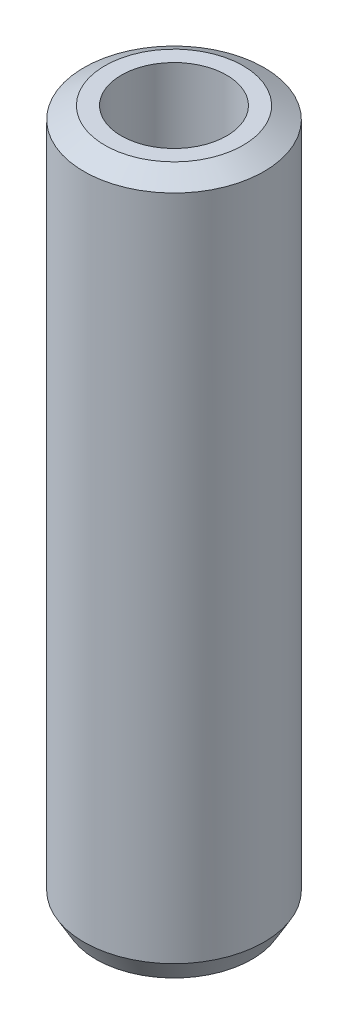
ISO-10303-21;
HEADER;
FILE_DESCRIPTION(('STEP AP214'),'2;1');
FILE_NAME('part.step','',(''),(''),'','','');
FILE_SCHEMA(('AUTOMOTIVE_DESIGN { 1 0 10303 214 1 1 1 1 }'));
ENDSEC;
DATA;
#1=APPLICATION_CONTEXT('core data for automotive mechanical design processes');
#2=APPLICATION_PROTOCOL_DEFINITION('international standard','automotive_design',2000,#1);
#3=PRODUCT_CONTEXT('',#1,'mechanical');
#4=PRODUCT('Part','Part','',(#3));
#5=PRODUCT_RELATED_PRODUCT_CATEGORY('part','',(#4));
#6=PRODUCT_DEFINITION_FORMATION('','',#4);
#7=PRODUCT_DEFINITION_CONTEXT('part definition',#1,'design');
#8=PRODUCT_DEFINITION('design','',#6,#7);
#9=PRODUCT_DEFINITION_SHAPE('','',#8);
#10=(LENGTH_UNIT() NAMED_UNIT(*) SI_UNIT(.MILLI.,.METRE.));
#11=(NAMED_UNIT(*) PLANE_ANGLE_UNIT() SI_UNIT($,.RADIAN.));
#12=(NAMED_UNIT(*) SI_UNIT($,.STERADIAN.) SOLID_ANGLE_UNIT());
#13=UNCERTAINTY_MEASURE_WITH_UNIT(LENGTH_MEASURE(1.E-05),#10,'distance_accuracy_value','');
#14=(GEOMETRIC_REPRESENTATION_CONTEXT(3) GLOBAL_UNCERTAINTY_ASSIGNED_CONTEXT((#13)) GLOBAL_UNIT_ASSIGNED_CONTEXT((#10,
#11,#12)) REPRESENTATION_CONTEXT('',''));
#15=CARTESIAN_POINT('',(0.,0.,0.));
#16=DIRECTION('',(0.,0.,1.));
#17=DIRECTION('',(1.,0.,0.));
#18=AXIS2_PLACEMENT_3D('',#15,#16,#17);
#19=CARTESIAN_POINT('',(0.,233.354073189803,0.));
#20=DIRECTION('',(0.,-1.,0.));
#21=DIRECTION('',(0.,0.,-1.));
#22=AXIS2_PLACEMENT_3D('',#19,#20,#21);
#23=CYLINDRICAL_SURFACE('',#22,30.);
#24=CARTESIAN_POINT('',(0.,229.31092209963,0.));
#25=DIRECTION('',(0.,1.,0.));
#26=DIRECTION('',(0.,0.,1.));
#27=AXIS2_PLACEMENT_3D('',#24,#25,#26);
#28=CIRCLE('',#27,30.);
#29=CARTESIAN_POINT('',(0.,229.31092209963,-30.));
#30=VERTEX_POINT('',#29);
#31=EDGE_CURVE('E50',#30,#30,#28,.F.);
#32=ORIENTED_EDGE('',*,*,#31,.T.);
#33=EDGE_LOOP('',(#32));
#34=FACE_BOUND('',#33,.T.);
#35=CARTESIAN_POINT('',(0.,7.00294311085678,0.));
#36=DIRECTION('',(0.,1.,0.));
#37=DIRECTION('',(0.,0.,1.));
#38=AXIS2_PLACEMENT_3D('',#35,#36,#37);
#39=CIRCLE('',#38,30.);
#40=CARTESIAN_POINT('',(0.,7.00294311085678,30.));
#41=VERTEX_POINT('',#40);
#42=EDGE_CURVE('E51',#41,#41,#39,.T.);
#43=ORIENTED_EDGE('',*,*,#42,.T.);
#44=EDGE_LOOP('',(#43));
#45=FACE_BOUND('',#44,.T.);
#46=ADVANCED_FACE('F39',(#34,#45),#23,.T.);
#47=CARTESIAN_POINT('',(0.,233.354073189803,0.));
#48=DIRECTION('',(0.,1.,0.));
#49=DIRECTION('',(0.,0.,1.));
#50=AXIS2_PLACEMENT_3D('',#47,#48,#49);
#51=PLANE('',#50);
#52=CARTESIAN_POINT('',(0.,233.354073189803,0.));
#53=DIRECTION('',(0.,1.,0.));
#54=DIRECTION('',(0.,0.,1.));
#55=AXIS2_PLACEMENT_3D('',#52,#53,#54);
#56=CIRCLE('',#55,22.9970568891434);
#57=CARTESIAN_POINT('',(0.,233.354073189803,-22.9970568891434));
#58=VERTEX_POINT('',#57);
#59=EDGE_CURVE('E54',#58,#58,#56,.T.);
#60=ORIENTED_EDGE('',*,*,#59,.T.);
#61=EDGE_LOOP('',(#60));
#62=FACE_BOUND('',#61,.T.);
#63=CARTESIAN_POINT('',(0.,233.354073189803,0.));
#64=DIRECTION('',(0.,1.,0.));
#65=DIRECTION('',(0.,0.,1.));
#66=AXIS2_PLACEMENT_3D('',#63,#64,#65);
#67=CIRCLE('',#66,17.5480515872049);
#68=CARTESIAN_POINT('',(0.,233.354073189803,17.5480515872049));
#69=VERTEX_POINT('',#68);
#70=EDGE_CURVE('E58',#69,#69,#67,.T.);
#71=ORIENTED_EDGE('',*,*,#70,.F.);
#72=EDGE_LOOP('',(#71));
#73=FACE_BOUND('',#72,.T.);
#74=ADVANCED_FACE('F69',(#62,#73),#51,.T.);
#75=CARTESIAN_POINT('',(0.,0.,0.));
#76=DIRECTION('',(0.,1.,0.));
#77=DIRECTION('',(0.,0.,1.));
#78=AXIS2_PLACEMENT_3D('',#75,#76,#77);
#79=PLANE('',#78);
#80=CARTESIAN_POINT('',(0.,0.,0.));
#81=DIRECTION('',(0.,1.,0.));
#82=DIRECTION('',(0.,0.,1.));
#83=AXIS2_PLACEMENT_3D('',#80,#81,#82);
#84=CIRCLE('',#83,25.9568489098272);
#85=CARTESIAN_POINT('',(0.,0.,25.9568489098272));
#86=VERTEX_POINT('',#85);
#87=EDGE_CURVE('E10',#86,#86,#84,.F.);
#88=ORIENTED_EDGE('',*,*,#87,.T.);
#89=EDGE_LOOP('',(#88));
#90=FACE_BOUND('',#89,.T.);
#91=CARTESIAN_POINT('',(0.,0.,0.));
#92=DIRECTION('',(0.,1.,0.));
#93=DIRECTION('',(0.,0.,1.));
#94=AXIS2_PLACEMENT_3D('',#91,#92,#93);
#95=CIRCLE('',#94,17.5480515872049);
#96=CARTESIAN_POINT('',(0.,0.,17.5480515872049));
#97=VERTEX_POINT('',#96);
#98=EDGE_CURVE('E63',#97,#97,#95,.T.);
#99=ORIENTED_EDGE('',*,*,#98,.T.);
#100=EDGE_LOOP('',(#99));
#101=FACE_BOUND('',#100,.T.);
#102=ADVANCED_FACE('F75',(#90,#101),#79,.F.);
#103=CARTESIAN_POINT('',(0.,233.354073189803,0.));
#104=DIRECTION('',(0.,-1.,0.));
#105=DIRECTION('',(0.,0.,-1.));
#106=AXIS2_PLACEMENT_3D('',#103,#104,#105);
#107=CYLINDRICAL_SURFACE('',#106,17.5480515872049);
#108=ORIENTED_EDGE('',*,*,#70,.T.);
#109=EDGE_LOOP('',(#108));
#110=FACE_BOUND('',#109,.T.);
#111=ORIENTED_EDGE('',*,*,#98,.F.);
#112=EDGE_LOOP('',(#111));
#113=FACE_BOUND('',#112,.T.);
#114=ADVANCED_FACE('F70',(#110,#113),#107,.F.);
#115=CARTESIAN_POINT('',(0.,233.354073189803,0.));
#116=DIRECTION('',(0.,-1.,0.));
#117=DIRECTION('',(0.,0.,-1.));
#118=AXIS2_PLACEMENT_3D('',#115,#116,#117);
#119=CONICAL_SURFACE('',#118,22.9970568891434,1.04719755119659);
#120=CARTESIAN_POINT('',(0.,229.31092209963,-30.));
#121=CARTESIAN_POINT('',(0.,229.353038256819,-29.9270526759286));
#122=CARTESIAN_POINT('',(0.,229.395154414008,-29.8541053518572));
#123=CARTESIAN_POINT('',(0.,229.479386728387,-29.7082107037143));
#124=CARTESIAN_POINT('',(0.,229.521502885576,-29.6352633796429));
#125=CARTESIAN_POINT('',(0.,229.605735199955,-29.4893687315001));
#126=CARTESIAN_POINT('',(0.,229.647851357144,-29.4164214074286));
#127=CARTESIAN_POINT('',(0.,229.732083671523,-29.2705267592858));
#128=CARTESIAN_POINT('',(0.,229.774199828712,-29.1975794352144));
#129=CARTESIAN_POINT('',(0.,229.858432143091,-29.0516847870715));
#130=CARTESIAN_POINT('',(0.,229.90054830028,-28.9787374630001));
#131=CARTESIAN_POINT('',(0.,229.984780614659,-28.8328428148572));
#132=CARTESIAN_POINT('',(0.,230.026896771848,-28.7598954907858));
#133=CARTESIAN_POINT('',(0.,230.111129086226,-28.614000842643));
#134=CARTESIAN_POINT('',(0.,230.153245243416,-28.5410535185716));
#135=CARTESIAN_POINT('',(0.,230.237477557794,-28.3951588704287));
#136=CARTESIAN_POINT('',(0.,230.279593714984,-28.3222115463573));
#137=CARTESIAN_POINT('',(0.,230.363826029362,-28.1763168982144));
#138=CARTESIAN_POINT('',(0.,230.405942186552,-28.103369574143));
#139=CARTESIAN_POINT('',(0.,230.49017450093,-27.9574749260002));
#140=CARTESIAN_POINT('',(0.,230.53229065812,-27.8845276019287));
#141=CARTESIAN_POINT('',(0.,230.616522972498,-27.7386329537859));
#142=CARTESIAN_POINT('',(0.,230.658639129687,-27.6656856297145));
#143=CARTESIAN_POINT('',(0.,230.742871444066,-27.5197909815716));
#144=CARTESIAN_POINT('',(0.,230.784987601255,-27.4468436575002));
#145=CARTESIAN_POINT('',(0.,230.869219915634,-27.3009490093574));
#146=CARTESIAN_POINT('',(0.,230.911336072823,-27.2280016852859));
#147=CARTESIAN_POINT('',(0.,230.995568387202,-27.0821070371431));
#148=CARTESIAN_POINT('',(0.,231.037684544391,-27.0091597130717));
#149=CARTESIAN_POINT('',(0.,231.12191685877,-26.8632650649288));
#150=CARTESIAN_POINT('',(0.,231.164033015959,-26.7903177408574));
#151=CARTESIAN_POINT('',(0.,231.248265330338,-26.6444230927146));
#152=CARTESIAN_POINT('',(0.,231.290381487527,-26.5714757686431));
#153=CARTESIAN_POINT('',(0.,231.374613801905,-26.4255811205003));
#154=CARTESIAN_POINT('',(0.,231.416729959095,-26.3526337964289));
#155=CARTESIAN_POINT('',(0.,231.500962273473,-26.206739148286));
#156=CARTESIAN_POINT('',(0.,231.543078430663,-26.1337918242146));
#157=CARTESIAN_POINT('',(0.,231.627310745041,-25.9878971760717));
#158=CARTESIAN_POINT('',(0.,231.669426902231,-25.9149498520003));
#159=CARTESIAN_POINT('',(0.,231.753659216609,-25.7690552038575));
#160=CARTESIAN_POINT('',(0.,231.795775373799,-25.696107879786));
#161=CARTESIAN_POINT('',(0.,231.880007688177,-25.5502132316432));
#162=CARTESIAN_POINT('',(0.,231.922123845366,-25.4772659075718));
#163=CARTESIAN_POINT('',(0.,232.006356159745,-25.3313712594289));
#164=CARTESIAN_POINT('',(0.,232.048472316934,-25.2584239353575));
#165=CARTESIAN_POINT('',(0.,232.132704631313,-25.1125292872147));
#166=CARTESIAN_POINT('',(0.,232.174820788502,-25.0395819631432));
#167=CARTESIAN_POINT('',(0.,232.259053102881,-24.8936873150004));
#168=CARTESIAN_POINT('',(0.,232.30116926007,-24.820739990929));
#169=CARTESIAN_POINT('',(0.,232.385401574449,-24.6748453427861));
#170=CARTESIAN_POINT('',(0.,232.427517731638,-24.6018980187147));
#171=CARTESIAN_POINT('',(0.,232.511750046017,-24.4560033705718));
#172=CARTESIAN_POINT('',(0.,232.553866203206,-24.3830560465004));
#173=CARTESIAN_POINT('',(0.,232.638098517584,-24.2371613983576));
#174=CARTESIAN_POINT('',(0.,232.680214674774,-24.1642140742862));
#175=CARTESIAN_POINT('',(0.,232.764446989152,-24.0183194261433));
#176=CARTESIAN_POINT('',(0.,232.806563146342,-23.9453721020719));
#177=CARTESIAN_POINT('',(0.,232.89079546072,-23.799477453929));
#178=CARTESIAN_POINT('',(0.,232.93291161791,-23.7265301298576));
#179=CARTESIAN_POINT('',(0.,233.017143932288,-23.5806354817148));
#180=CARTESIAN_POINT('',(0.,233.059260089477,-23.5076881576433));
#181=CARTESIAN_POINT('',(0.,233.143492403856,-23.3617935095005));
#182=CARTESIAN_POINT('',(0.,233.185608561045,-23.2888461854291));
#183=CARTESIAN_POINT('',(0.,233.269840875424,-23.1429515372862));
#184=CARTESIAN_POINT('',(0.,233.311957032613,-23.0700042132148));
#185=CARTESIAN_POINT('',(0.,233.354073189803,-22.9970568891434));
#186=B_SPLINE_CURVE_WITH_KNOTS('',3,(#120,#121,#122,#123,#124,#125,#126,#127,#128,#129,#130,
#131,#132,#133,#134,#135,#136,#137,#138,#139,#140,#141,#142,#143,#144,#145,#146,#147,#148,#149,
#150,#151,#152,#153,#154,#155,#156,#157,#158,#159,#160,#161,#162,#163,#164,#165,#166,#167,#168,
#169,#170,#171,#172,#173,#174,#175,#176,#177,#178,#179,#180,#181,#182,#183,#184,#185),
.UNSPECIFIED.,.F.,.F.,(4,2,2,2,2,2,2,2,2,2,2,2,2,2,2,2,2,2,2,2,2,2,2,2,2,2,2,2,2,2,2,2,4),(0.,
0.252696943135809,0.5053938862716,0.758090829407395,1.01078777254319,1.26348471567898,
1.51618165881478,1.76887860195058,2.02157554508637,2.27427248822217,2.52696943135796,
2.77966637449376,3.03236331762955,3.28506026076536,3.53775720390115,3.79045414703694,
4.04315109017274,4.29584803330853,4.54854497644432,4.80124191958012,5.05393886271592,
5.30663580585172,5.55933274898751,5.8120296921233,6.0647266352591,6.31742357839489,
6.5701205215307,6.82281746466649,7.07551440780228,7.32821135093808,7.58090829407387,
7.83360523720966,8.08630218034547),.UNSPECIFIED.);
#187=EDGE_CURVE('BSEAM81',#30,#58,#186,.T.);
#188=ORIENTED_EDGE('',*,*,#31,.F.);
#189=ORIENTED_EDGE('',*,*,#59,.F.);
#190=ORIENTED_EDGE('',*,*,#187,.T.);
#191=ORIENTED_EDGE('',*,*,#187,.F.);
#192=EDGE_LOOP('',(#188,#190,#189,#191));
#193=FACE_BOUND('',#192,.T.);
#194=ADVANCED_FACE('F81',(#193),#119,.T.);
#195=CARTESIAN_POINT('',(0.,7.00294311085678,0.));
#196=DIRECTION('',(0.,1.,0.));
#197=DIRECTION('',(0.,0.,1.));
#198=AXIS2_PLACEMENT_3D('',#195,#196,#197);
#199=CONICAL_SURFACE('',#198,30.,0.523598775598303);
#200=ORIENTED_EDGE('',*,*,#87,.F.);
#201=EDGE_LOOP('',(#200));
#202=FACE_BOUND('',#201,.T.);
#203=ORIENTED_EDGE('',*,*,#42,.F.);
#204=EDGE_LOOP('',(#203));
#205=FACE_BOUND('',#204,.T.);
#206=ADVANCED_FACE('F45',(#202,#205),#199,.T.);
#207=CLOSED_SHELL('',(#46,#74,#102,#114,#194,#206));
#208=MANIFOLD_SOLID_BREP('B2',#207);
#209=ADVANCED_BREP_SHAPE_REPRESENTATION('',(#18,#208),#14);
#210=SHAPE_DEFINITION_REPRESENTATION(#9,#209);
ENDSEC;
END-ISO-10303-21;
